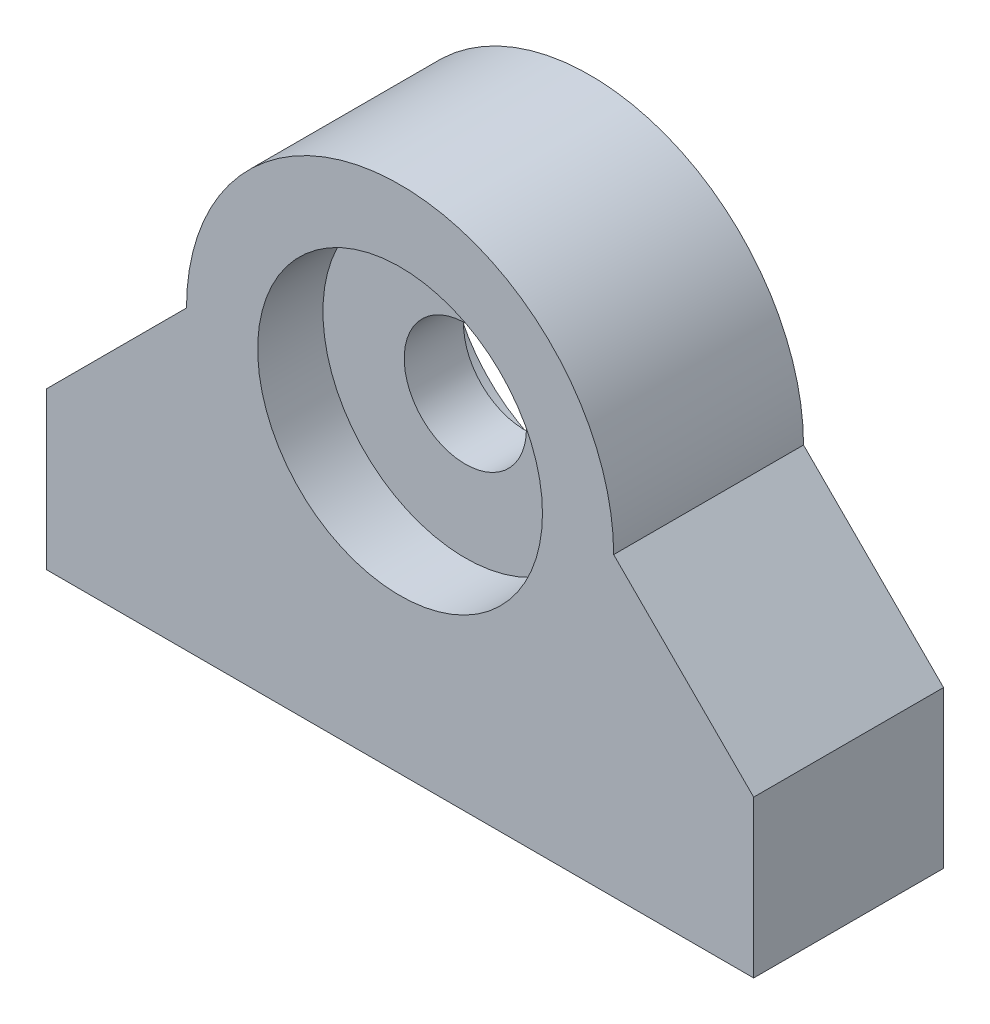
ISO-10303-21;
HEADER;
FILE_DESCRIPTION(('STEP AP214'),'2;1');
FILE_NAME('part.step','',(''),(''),'','','');
FILE_SCHEMA(('AUTOMOTIVE_DESIGN { 1 0 10303 214 1 1 1 1 }'));
ENDSEC;
DATA;
#1=APPLICATION_CONTEXT('core data for automotive mechanical design processes');
#2=APPLICATION_PROTOCOL_DEFINITION('international standard','automotive_design',2000,#1);
#3=PRODUCT_CONTEXT('',#1,'mechanical');
#4=PRODUCT('Part','Part','',(#3));
#5=PRODUCT_RELATED_PRODUCT_CATEGORY('part','',(#4));
#6=PRODUCT_DEFINITION_FORMATION('','',#4);
#7=PRODUCT_DEFINITION_CONTEXT('part definition',#1,'design');
#8=PRODUCT_DEFINITION('design','',#6,#7);
#9=PRODUCT_DEFINITION_SHAPE('','',#8);
#10=(LENGTH_UNIT() NAMED_UNIT(*) SI_UNIT(.MILLI.,.METRE.));
#11=(NAMED_UNIT(*) PLANE_ANGLE_UNIT() SI_UNIT($,.RADIAN.));
#12=(NAMED_UNIT(*) SI_UNIT($,.STERADIAN.) SOLID_ANGLE_UNIT());
#13=UNCERTAINTY_MEASURE_WITH_UNIT(LENGTH_MEASURE(1.E-05),#10,'distance_accuracy_value','');
#14=(GEOMETRIC_REPRESENTATION_CONTEXT(3) GLOBAL_UNCERTAINTY_ASSIGNED_CONTEXT((#13)) GLOBAL_UNIT_ASSIGNED_CONTEXT((#10,
#11,#12)) REPRESENTATION_CONTEXT('',''));
#15=CARTESIAN_POINT('',(0.,0.,0.));
#16=DIRECTION('',(0.,0.,1.));
#17=DIRECTION('',(1.,0.,0.));
#18=AXIS2_PLACEMENT_3D('',#15,#16,#17);
#19=CARTESIAN_POINT('',(0.,15.875,10.16));
#20=DIRECTION('',(0.,0.,-1.));
#21=DIRECTION('',(-1.,0.,0.));
#22=AXIS2_PLACEMENT_3D('',#19,#20,#21);
#23=CYLINDRICAL_SURFACE('',#22,7.62);
#24=CARTESIAN_POINT('',(0.,15.875,0.));
#25=DIRECTION('',(0.,0.,1.));
#26=DIRECTION('',(1.,0.,0.));
#27=AXIS2_PLACEMENT_3D('',#24,#25,#26);
#28=CIRCLE('',#27,7.62);
#29=CARTESIAN_POINT('',(7.62,15.875,0.));
#30=VERTEX_POINT('',#29);
#31=EDGE_CURVE('E153',#30,#30,#28,.T.);
#32=ORIENTED_EDGE('',*,*,#31,.F.);
#33=EDGE_LOOP('',(#32));
#34=FACE_BOUND('',#33,.T.);
#35=CARTESIAN_POINT('',(0.,15.875,3.4925));
#36=DIRECTION('',(0.,0.,1.));
#37=DIRECTION('',(1.,0.,0.));
#38=AXIS2_PLACEMENT_3D('',#35,#36,#37);
#39=CIRCLE('',#38,7.62);
#40=CARTESIAN_POINT('',(7.62,15.875,3.4925));
#41=VERTEX_POINT('',#40);
#42=EDGE_CURVE('E37',#41,#41,#39,.T.);
#43=ORIENTED_EDGE('',*,*,#42,.T.);
#44=EDGE_LOOP('',(#43));
#45=FACE_BOUND('',#44,.T.);
#46=ADVANCED_FACE('F33',(#34,#45),#23,.F.);
#47=CARTESIAN_POINT('',(0.,15.875,10.16));
#48=DIRECTION('',(0.,0.,-1.));
#49=DIRECTION('',(-1.,0.,0.));
#50=AXIS2_PLACEMENT_3D('',#47,#48,#49);
#51=PLANE('',#50);
#52=DIRECTION('',(1.,0.,0.));
#53=VECTOR('',#52,1.);
#54=CARTESIAN_POINT('',(0.,0.,10.16));
#55=LINE('',#54,#53);
#56=CARTESIAN_POINT('',(-18.923,0.,10.16));
#57=VERTEX_POINT('',#56);
#58=CARTESIAN_POINT('',(18.923,0.,10.16));
#59=VERTEX_POINT('',#58);
#60=EDGE_CURVE('E51',#57,#59,#55,.T.);
#61=ORIENTED_EDGE('',*,*,#60,.T.);
#62=DIRECTION('',(0.,1.,0.));
#63=VECTOR('',#62,1.);
#64=CARTESIAN_POINT('',(18.923,0.,10.16));
#65=LINE('',#64,#63);
#66=CARTESIAN_POINT('',(18.923,8.38200000000003,10.16));
#67=VERTEX_POINT('',#66);
#68=EDGE_CURVE('E90',#59,#67,#65,.T.);
#69=ORIENTED_EDGE('',*,*,#68,.T.);
#70=DIRECTION('',(-0.707106781186549,0.707106781186546,0.));
#71=VECTOR('',#70,1.);
#72=CARTESIAN_POINT('',(18.923,8.38200000000003,10.16));
#73=LINE('',#72,#71);
#74=CARTESIAN_POINT('',(11.43,15.875,10.16));
#75=VERTEX_POINT('',#74);
#76=EDGE_CURVE('E105',#67,#75,#73,.T.);
#77=ORIENTED_EDGE('',*,*,#76,.T.);
#78=CARTESIAN_POINT('',(0.,15.875,10.16));
#79=DIRECTION('',(0.,0.,1.));
#80=DIRECTION('',(-1.,0.,0.));
#81=AXIS2_PLACEMENT_3D('',#78,#79,#80);
#82=CIRCLE('',#81,11.43);
#83=CARTESIAN_POINT('',(-11.43,15.875,10.16));
#84=VERTEX_POINT('',#83);
#85=EDGE_CURVE('E98',#75,#84,#82,.T.);
#86=ORIENTED_EDGE('',*,*,#85,.T.);
#87=DIRECTION('',(-0.707106781186549,-0.707106781186546,0.));
#88=VECTOR('',#87,1.);
#89=CARTESIAN_POINT('',(-18.923,8.38200000000003,10.16));
#90=LINE('',#89,#88);
#91=CARTESIAN_POINT('',(-18.923,8.38200000000003,10.16));
#92=VERTEX_POINT('',#91);
#93=EDGE_CURVE('E103',#84,#92,#90,.T.);
#94=ORIENTED_EDGE('',*,*,#93,.T.);
#95=DIRECTION('',(0.,-1.,0.));
#96=VECTOR('',#95,1.);
#97=CARTESIAN_POINT('',(-18.923,0.,10.16));
#98=LINE('',#97,#96);
#99=EDGE_CURVE('E119',#92,#57,#98,.T.);
#100=ORIENTED_EDGE('',*,*,#99,.T.);
#101=EDGE_LOOP('',(#61,#69,#77,#86,#94,#100));
#102=FACE_BOUND('',#101,.T.);
#103=CARTESIAN_POINT('',(0.,15.875,10.16));
#104=DIRECTION('',(0.,0.,1.));
#105=DIRECTION('',(1.,0.,0.));
#106=AXIS2_PLACEMENT_3D('',#103,#104,#105);
#107=CIRCLE('',#106,7.62);
#108=CARTESIAN_POINT('',(7.62,15.875,10.16));
#109=VERTEX_POINT('',#108);
#110=EDGE_CURVE('E128',#109,#109,#107,.T.);
#111=ORIENTED_EDGE('',*,*,#110,.F.);
#112=EDGE_LOOP('',(#111));
#113=FACE_BOUND('',#112,.T.);
#114=ADVANCED_FACE('F100',(#102,#113),#51,.F.);
#115=CARTESIAN_POINT('',(0.,15.875,0.));
#116=DIRECTION('',(0.,0.,-1.));
#117=DIRECTION('',(-1.,0.,0.));
#118=AXIS2_PLACEMENT_3D('',#115,#116,#117);
#119=PLANE('',#118);
#120=DIRECTION('',(0.,1.,0.));
#121=VECTOR('',#120,1.);
#122=CARTESIAN_POINT('',(18.923,0.,0.));
#123=LINE('',#122,#121);
#124=CARTESIAN_POINT('',(18.923,0.,0.));
#125=VERTEX_POINT('',#124);
#126=CARTESIAN_POINT('',(18.923,8.38200000000003,0.));
#127=VERTEX_POINT('',#126);
#128=EDGE_CURVE('E125',#125,#127,#123,.T.);
#129=ORIENTED_EDGE('',*,*,#128,.F.);
#130=DIRECTION('',(1.,0.,0.));
#131=VECTOR('',#130,1.);
#132=CARTESIAN_POINT('',(0.,0.,0.));
#133=LINE('',#132,#131);
#134=CARTESIAN_POINT('',(-18.923,0.,0.));
#135=VERTEX_POINT('',#134);
#136=EDGE_CURVE('E133',#135,#125,#133,.T.);
#137=ORIENTED_EDGE('',*,*,#136,.F.);
#138=DIRECTION('',(0.,-1.,0.));
#139=VECTOR('',#138,1.);
#140=CARTESIAN_POINT('',(-18.923,0.,0.));
#141=LINE('',#140,#139);
#142=CARTESIAN_POINT('',(-18.923,8.38200000000003,0.));
#143=VERTEX_POINT('',#142);
#144=EDGE_CURVE('E82',#143,#135,#141,.T.);
#145=ORIENTED_EDGE('',*,*,#144,.F.);
#146=DIRECTION('',(-0.707106781186549,-0.707106781186546,0.));
#147=VECTOR('',#146,1.);
#148=CARTESIAN_POINT('',(-18.923,8.38200000000003,0.));
#149=LINE('',#148,#147);
#150=CARTESIAN_POINT('',(-11.43,15.875,0.));
#151=VERTEX_POINT('',#150);
#152=EDGE_CURVE('E75',#151,#143,#149,.T.);
#153=ORIENTED_EDGE('',*,*,#152,.F.);
#154=CARTESIAN_POINT('',(0.,15.875,0.));
#155=DIRECTION('',(0.,0.,1.));
#156=DIRECTION('',(-1.,0.,0.));
#157=AXIS2_PLACEMENT_3D('',#154,#155,#156);
#158=CIRCLE('',#157,11.43);
#159=CARTESIAN_POINT('',(11.43,15.875,0.));
#160=VERTEX_POINT('',#159);
#161=EDGE_CURVE('E113',#160,#151,#158,.T.);
#162=ORIENTED_EDGE('',*,*,#161,.F.);
#163=DIRECTION('',(-0.707106781186549,0.707106781186546,0.));
#164=VECTOR('',#163,1.);
#165=CARTESIAN_POINT('',(18.923,8.38200000000003,0.));
#166=LINE('',#165,#164);
#167=EDGE_CURVE('E127',#127,#160,#166,.T.);
#168=ORIENTED_EDGE('',*,*,#167,.F.);
#169=EDGE_LOOP('',(#129,#137,#145,#153,#162,#168));
#170=FACE_BOUND('',#169,.T.);
#171=ORIENTED_EDGE('',*,*,#31,.T.);
#172=EDGE_LOOP('',(#171));
#173=FACE_BOUND('',#172,.T.);
#174=ADVANCED_FACE('F146',(#170,#173),#119,.T.);
#175=CARTESIAN_POINT('',(18.923,0.,10.16));
#176=DIRECTION('',(-1.,0.,0.));
#177=DIRECTION('',(0.,0.,1.));
#178=AXIS2_PLACEMENT_3D('',#175,#176,#177);
#179=PLANE('',#178);
#180=ORIENTED_EDGE('',*,*,#128,.T.);
#181=DIRECTION('',(0.,0.,-1.));
#182=VECTOR('',#181,1.);
#183=CARTESIAN_POINT('',(18.923,8.38200000000003,10.16));
#184=LINE('',#183,#182);
#185=EDGE_CURVE('E138',#67,#127,#184,.T.);
#186=ORIENTED_EDGE('',*,*,#185,.F.);
#187=ORIENTED_EDGE('',*,*,#68,.F.);
#188=DIRECTION('',(0.,0.,-1.));
#189=VECTOR('',#188,1.);
#190=CARTESIAN_POINT('',(18.923,0.,10.16));
#191=LINE('',#190,#189);
#192=EDGE_CURVE('E43',#59,#125,#191,.T.);
#193=ORIENTED_EDGE('',*,*,#192,.T.);
#194=EDGE_LOOP('',(#180,#186,#187,#193));
#195=FACE_BOUND('',#194,.T.);
#196=ADVANCED_FACE('F35',(#195),#179,.F.);
#197=CARTESIAN_POINT('',(18.923,8.38200000000003,10.16));
#198=DIRECTION('',(-0.707106781186546,-0.707106781186549,0.));
#199=DIRECTION('',(0.707106781186549,-0.707106781186546,0.));
#200=AXIS2_PLACEMENT_3D('',#197,#198,#199);
#201=PLANE('',#200);
#202=ORIENTED_EDGE('',*,*,#167,.T.);
#203=DIRECTION('',(0.,0.,-1.));
#204=VECTOR('',#203,1.);
#205=CARTESIAN_POINT('',(11.43,15.875,10.16));
#206=LINE('',#205,#204);
#207=EDGE_CURVE('E114',#75,#160,#206,.T.);
#208=ORIENTED_EDGE('',*,*,#207,.F.);
#209=ORIENTED_EDGE('',*,*,#76,.F.);
#210=ORIENTED_EDGE('',*,*,#185,.T.);
#211=EDGE_LOOP('',(#202,#208,#209,#210));
#212=FACE_BOUND('',#211,.T.);
#213=ADVANCED_FACE('F149',(#212),#201,.F.);
#214=CARTESIAN_POINT('',(0.,15.875,10.16));
#215=DIRECTION('',(0.,0.,-1.));
#216=DIRECTION('',(-1.,0.,0.));
#217=AXIS2_PLACEMENT_3D('',#214,#215,#216);
#218=CYLINDRICAL_SURFACE('',#217,11.43);
#219=ORIENTED_EDGE('',*,*,#161,.T.);
#220=DIRECTION('',(0.,0.,-1.));
#221=VECTOR('',#220,1.);
#222=CARTESIAN_POINT('',(-11.43,15.875,10.16));
#223=LINE('',#222,#221);
#224=EDGE_CURVE('E110',#84,#151,#223,.T.);
#225=ORIENTED_EDGE('',*,*,#224,.F.);
#226=ORIENTED_EDGE('',*,*,#85,.F.);
#227=ORIENTED_EDGE('',*,*,#207,.T.);
#228=EDGE_LOOP('',(#219,#225,#226,#227));
#229=FACE_BOUND('',#228,.T.);
#230=ADVANCED_FACE('F111',(#229),#218,.T.);
#231=CARTESIAN_POINT('',(-18.923,8.38200000000003,10.16));
#232=DIRECTION('',(0.707106781186546,-0.707106781186549,0.));
#233=DIRECTION('',(0.707106781186549,0.707106781186546,0.));
#234=AXIS2_PLACEMENT_3D('',#231,#232,#233);
#235=PLANE('',#234);
#236=ORIENTED_EDGE('',*,*,#152,.T.);
#237=DIRECTION('',(0.,0.,-1.));
#238=VECTOR('',#237,1.);
#239=CARTESIAN_POINT('',(-18.923,8.38200000000003,10.16));
#240=LINE('',#239,#238);
#241=EDGE_CURVE('E115',#92,#143,#240,.T.);
#242=ORIENTED_EDGE('',*,*,#241,.F.);
#243=ORIENTED_EDGE('',*,*,#93,.F.);
#244=ORIENTED_EDGE('',*,*,#224,.T.);
#245=EDGE_LOOP('',(#236,#242,#243,#244));
#246=FACE_BOUND('',#245,.T.);
#247=ADVANCED_FACE('F117',(#246),#235,.F.);
#248=CARTESIAN_POINT('',(-18.923,0.,10.16));
#249=DIRECTION('',(1.,0.,0.));
#250=DIRECTION('',(0.,0.,-1.));
#251=AXIS2_PLACEMENT_3D('',#248,#249,#250);
#252=PLANE('',#251);
#253=ORIENTED_EDGE('',*,*,#144,.T.);
#254=DIRECTION('',(0.,0.,-1.));
#255=VECTOR('',#254,1.);
#256=CARTESIAN_POINT('',(-18.923,0.,10.16));
#257=LINE('',#256,#255);
#258=EDGE_CURVE('E121',#57,#135,#257,.T.);
#259=ORIENTED_EDGE('',*,*,#258,.F.);
#260=ORIENTED_EDGE('',*,*,#99,.F.);
#261=ORIENTED_EDGE('',*,*,#241,.T.);
#262=EDGE_LOOP('',(#253,#259,#260,#261));
#263=FACE_BOUND('',#262,.T.);
#264=ADVANCED_FACE('F189',(#263),#252,.F.);
#265=CARTESIAN_POINT('',(0.,0.,10.16));
#266=DIRECTION('',(0.,1.,0.));
#267=DIRECTION('',(-1.,0.,0.));
#268=AXIS2_PLACEMENT_3D('',#265,#266,#267);
#269=PLANE('',#268);
#270=CARTESIAN_POINT('',(-10.16,0.,5.08));
#271=DIRECTION('',(0.,-1.,0.));
#272=DIRECTION('',(-1.,0.,0.));
#273=AXIS2_PLACEMENT_3D('',#270,#271,#272);
#274=CIRCLE('',#273,1.98374);
#275=CARTESIAN_POINT('',(-12.14374,0.,5.08));
#276=VERTEX_POINT('',#275);
#277=EDGE_CURVE('E171',#276,#276,#274,.T.);
#278=ORIENTED_EDGE('',*,*,#277,.F.);
#279=EDGE_LOOP('',(#278));
#280=FACE_BOUND('',#279,.T.);
#281=CARTESIAN_POINT('',(10.16,0.,5.08));
#282=DIRECTION('',(0.,-1.,0.));
#283=DIRECTION('',(1.,0.,0.));
#284=AXIS2_PLACEMENT_3D('',#281,#282,#283);
#285=CIRCLE('',#284,1.98374);
#286=CARTESIAN_POINT('',(12.14374,0.,5.08));
#287=VERTEX_POINT('',#286);
#288=EDGE_CURVE('E165',#287,#287,#285,.T.);
#289=ORIENTED_EDGE('',*,*,#288,.F.);
#290=EDGE_LOOP('',(#289));
#291=FACE_BOUND('',#290,.T.);
#292=ORIENTED_EDGE('',*,*,#136,.T.);
#293=ORIENTED_EDGE('',*,*,#192,.F.);
#294=ORIENTED_EDGE('',*,*,#60,.F.);
#295=ORIENTED_EDGE('',*,*,#258,.T.);
#296=EDGE_LOOP('',(#292,#293,#294,#295));
#297=FACE_BOUND('',#296,.T.);
#298=ADVANCED_FACE('F142',(#280,#291,#297),#269,.F.);
#299=CARTESIAN_POINT('',(0.,15.875,6.6675));
#300=DIRECTION('',(0.,0.,1.));
#301=DIRECTION('',(1.,0.,0.));
#302=AXIS2_PLACEMENT_3D('',#299,#300,#301);
#303=CIRCLE('',#302,7.62);
#304=CARTESIAN_POINT('',(7.62,15.875,6.6675));
#305=VERTEX_POINT('',#304);
#306=EDGE_CURVE('E11',#305,#305,#303,.T.);
#307=ORIENTED_EDGE('',*,*,#306,.F.);
#308=EDGE_LOOP('',(#307));
#309=FACE_BOUND('',#308,.T.);
#310=ORIENTED_EDGE('',*,*,#110,.T.);
#311=EDGE_LOOP('',(#310));
#312=FACE_BOUND('',#311,.T.);
#313=ADVANCED_FACE('F188',(#309,#312),#23,.F.);
#314=CARTESIAN_POINT('',(0.,15.875,3.4925));
#315=DIRECTION('',(0.,0.,1.));
#316=DIRECTION('',(1.,0.,0.));
#317=AXIS2_PLACEMENT_3D('',#314,#315,#316);
#318=PLANE('',#317);
#319=ORIENTED_EDGE('',*,*,#42,.F.);
#320=EDGE_LOOP('',(#319));
#321=FACE_BOUND('',#320,.T.);
#322=CARTESIAN_POINT('',(0.,15.875,3.4925));
#323=DIRECTION('',(0.,0.,1.));
#324=DIRECTION('',(1.,0.,0.));
#325=AXIS2_PLACEMENT_3D('',#322,#323,#324);
#326=CIRCLE('',#325,3.27025);
#327=CARTESIAN_POINT('',(3.27025,15.875,3.4925));
#328=VERTEX_POINT('',#327);
#329=EDGE_CURVE('E158',#328,#328,#326,.T.);
#330=ORIENTED_EDGE('',*,*,#329,.T.);
#331=EDGE_LOOP('',(#330));
#332=FACE_BOUND('',#331,.T.);
#333=ADVANCED_FACE('F219',(#321,#332),#318,.F.);
#334=CARTESIAN_POINT('',(0.,15.875,3.4925));
#335=DIRECTION('',(0.,0.,1.));
#336=DIRECTION('',(1.,0.,0.));
#337=AXIS2_PLACEMENT_3D('',#334,#335,#336);
#338=CYLINDRICAL_SURFACE('',#337,3.27025);
#339=ORIENTED_EDGE('',*,*,#329,.F.);
#340=EDGE_LOOP('',(#339));
#341=FACE_BOUND('',#340,.T.);
#342=CARTESIAN_POINT('',(0.,15.875,6.6675));
#343=DIRECTION('',(0.,0.,1.));
#344=DIRECTION('',(1.,0.,0.));
#345=AXIS2_PLACEMENT_3D('',#342,#343,#344);
#346=CIRCLE('',#345,3.27025);
#347=CARTESIAN_POINT('',(3.27025,15.875,6.6675));
#348=VERTEX_POINT('',#347);
#349=EDGE_CURVE('E161',#348,#348,#346,.T.);
#350=ORIENTED_EDGE('',*,*,#349,.T.);
#351=EDGE_LOOP('',(#350));
#352=FACE_BOUND('',#351,.T.);
#353=ADVANCED_FACE('F204',(#341,#352),#338,.F.);
#354=CARTESIAN_POINT('',(0.,15.875,6.6675));
#355=DIRECTION('',(0.,0.,1.));
#356=DIRECTION('',(1.,0.,0.));
#357=AXIS2_PLACEMENT_3D('',#354,#355,#356);
#358=PLANE('',#357);
#359=ORIENTED_EDGE('',*,*,#306,.T.);
#360=EDGE_LOOP('',(#359));
#361=FACE_BOUND('',#360,.T.);
#362=ORIENTED_EDGE('',*,*,#349,.F.);
#363=EDGE_LOOP('',(#362));
#364=FACE_BOUND('',#363,.T.);
#365=ADVANCED_FACE('F195',(#361,#364),#358,.T.);
#366=CARTESIAN_POINT('',(10.16,10.16,5.08));
#367=DIRECTION('',(0.,-1.,0.));
#368=DIRECTION('',(1.,0.,0.));
#369=AXIS2_PLACEMENT_3D('',#366,#367,#368);
#370=CYLINDRICAL_SURFACE('',#369,1.98374);
#371=CARTESIAN_POINT('',(10.16,10.16,5.08));
#372=DIRECTION('',(0.,-1.,0.));
#373=DIRECTION('',(1.,0.,0.));
#374=AXIS2_PLACEMENT_3D('',#371,#372,#373);
#375=CIRCLE('',#374,1.98374);
#376=CARTESIAN_POINT('',(12.14374,10.16,5.08));
#377=VERTEX_POINT('',#376);
#378=EDGE_CURVE('E164',#377,#377,#375,.T.);
#379=ORIENTED_EDGE('',*,*,#378,.F.);
#380=EDGE_LOOP('',(#379));
#381=FACE_BOUND('',#380,.T.);
#382=ORIENTED_EDGE('',*,*,#288,.T.);
#383=EDGE_LOOP('',(#382));
#384=FACE_BOUND('',#383,.T.);
#385=ADVANCED_FACE('F193',(#381,#384),#370,.F.);
#386=CARTESIAN_POINT('',(10.16,10.16,5.08));
#387=DIRECTION('',(0.,-1.,0.));
#388=DIRECTION('',(1.,0.,0.));
#389=AXIS2_PLACEMENT_3D('',#386,#387,#388);
#390=PLANE('',#389);
#391=ORIENTED_EDGE('',*,*,#378,.T.);
#392=EDGE_LOOP('',(#391));
#393=FACE_BOUND('',#392,.T.);
#394=ADVANCED_FACE('F182',(#393),#390,.T.);
#395=CARTESIAN_POINT('',(-10.16,10.16,5.08));
#396=DIRECTION('',(0.,-1.,0.));
#397=DIRECTION('',(1.,0.,0.));
#398=AXIS2_PLACEMENT_3D('',#395,#396,#397);
#399=CYLINDRICAL_SURFACE('',#398,1.98374);
#400=CARTESIAN_POINT('',(-10.16,10.16,5.08));
#401=DIRECTION('',(0.,-1.,0.));
#402=DIRECTION('',(-1.,0.,0.));
#403=AXIS2_PLACEMENT_3D('',#400,#401,#402);
#404=CIRCLE('',#403,1.98374);
#405=CARTESIAN_POINT('',(-12.14374,10.16,5.08));
#406=VERTEX_POINT('',#405);
#407=EDGE_CURVE('E168',#406,#406,#404,.T.);
#408=ORIENTED_EDGE('',*,*,#407,.F.);
#409=EDGE_LOOP('',(#408));
#410=FACE_BOUND('',#409,.T.);
#411=ORIENTED_EDGE('',*,*,#277,.T.);
#412=EDGE_LOOP('',(#411));
#413=FACE_BOUND('',#412,.T.);
#414=ADVANCED_FACE('F179',(#410,#413),#399,.F.);
#415=CARTESIAN_POINT('',(-10.16,10.16,5.08));
#416=DIRECTION('',(0.,1.,0.));
#417=DIRECTION('',(-1.,0.,0.));
#418=AXIS2_PLACEMENT_3D('',#415,#416,#417);
#419=PLANE('',#418);
#420=ORIENTED_EDGE('',*,*,#407,.T.);
#421=EDGE_LOOP('',(#420));
#422=FACE_BOUND('',#421,.T.);
#423=ADVANCED_FACE('F177',(#422),#419,.F.);
#424=CLOSED_SHELL('',(#46,#114,#174,#196,#213,#230,#247,#264,#298,#313,#333,#353,#365,#385,#394,
#414,#423));
#425=MANIFOLD_SOLID_BREP('B2',#424);
#426=ADVANCED_BREP_SHAPE_REPRESENTATION('',(#18,#425),#14);
#427=SHAPE_DEFINITION_REPRESENTATION(#9,#426);
ENDSEC;
END-ISO-10303-21;
